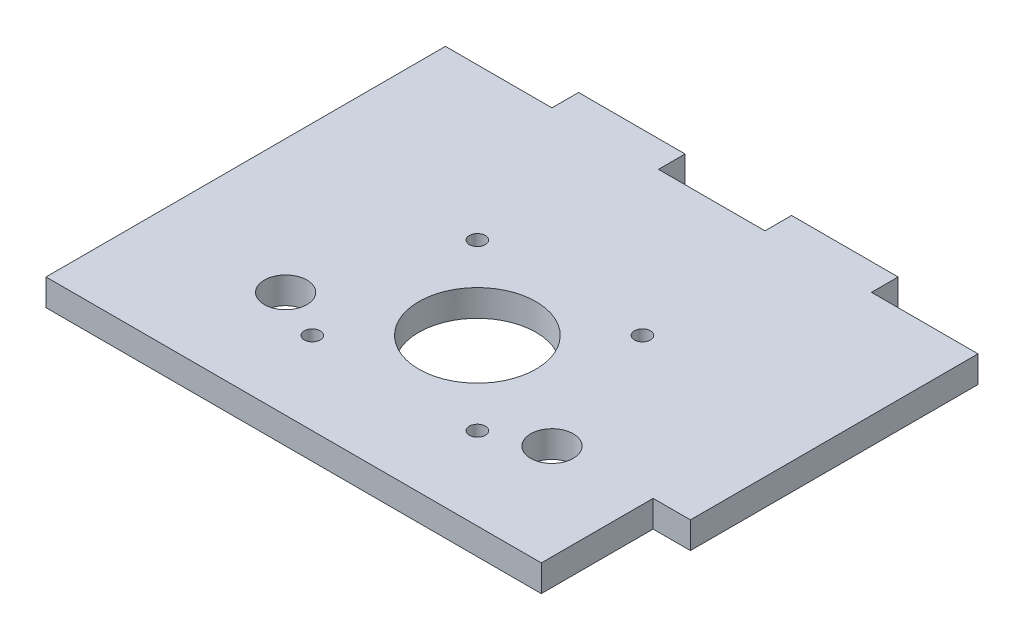
ISO-10303-21;
HEADER;
FILE_DESCRIPTION(('STEP AP214'),'2;1');
FILE_NAME('part.step','',(''),(''),'','','');
FILE_SCHEMA(('AUTOMOTIVE_DESIGN { 1 0 10303 214 1 1 1 1 }'));
ENDSEC;
DATA;
#1=APPLICATION_CONTEXT('core data for automotive mechanical design processes');
#2=APPLICATION_PROTOCOL_DEFINITION('international standard','automotive_design',2000,#1);
#3=PRODUCT_CONTEXT('',#1,'mechanical');
#4=PRODUCT('Part','Part','',(#3));
#5=PRODUCT_RELATED_PRODUCT_CATEGORY('part','',(#4));
#6=PRODUCT_DEFINITION_FORMATION('','',#4);
#7=PRODUCT_DEFINITION_CONTEXT('part definition',#1,'design');
#8=PRODUCT_DEFINITION('design','',#6,#7);
#9=PRODUCT_DEFINITION_SHAPE('','',#8);
#10=(LENGTH_UNIT() NAMED_UNIT(*) SI_UNIT(.MILLI.,.METRE.));
#11=(NAMED_UNIT(*) PLANE_ANGLE_UNIT() SI_UNIT($,.RADIAN.));
#12=(NAMED_UNIT(*) SI_UNIT($,.STERADIAN.) SOLID_ANGLE_UNIT());
#13=UNCERTAINTY_MEASURE_WITH_UNIT(LENGTH_MEASURE(1.E-05),#10,'distance_accuracy_value','');
#14=(GEOMETRIC_REPRESENTATION_CONTEXT(3) GLOBAL_UNCERTAINTY_ASSIGNED_CONTEXT((#13)) GLOBAL_UNIT_ASSIGNED_CONTEXT((#10,
#11,#12)) REPRESENTATION_CONTEXT('',''));
#15=CARTESIAN_POINT('',(0.,0.,0.));
#16=DIRECTION('',(0.,0.,1.));
#17=DIRECTION('',(1.,0.,0.));
#18=AXIS2_PLACEMENT_3D('',#15,#16,#17);
#19=CARTESIAN_POINT('',(0.,5.,0.));
#20=DIRECTION('',(0.,-1.,0.));
#21=DIRECTION('',(0.,0.,-1.));
#22=AXIS2_PLACEMENT_3D('',#19,#20,#21);
#23=PLANE('',#22);
#24=CARTESIAN_POINT('',(0.,5.,0.));
#25=DIRECTION('',(0.,1.,0.));
#26=DIRECTION('',(0.,0.,1.));
#27=AXIS2_PLACEMENT_3D('',#24,#25,#26);
#28=CIRCLE('',#27,11.);
#29=CARTESIAN_POINT('',(0.,5.,11.));
#30=VERTEX_POINT('',#29);
#31=EDGE_CURVE('E296',#30,#30,#28,.T.);
#32=ORIENTED_EDGE('',*,*,#31,.F.);
#33=EDGE_LOOP('',(#32));
#34=FACE_BOUND('',#33,.T.);
#35=DIRECTION('',(0.,0.,1.));
#36=VECTOR('',#35,1.);
#37=CARTESIAN_POINT('',(43.,5.,31.));
#38=LINE('',#37,#36);
#39=CARTESIAN_POINT('',(43.,5.,10.));
#40=VERTEX_POINT('',#39);
#41=CARTESIAN_POINT('',(43.,5.,31.));
#42=VERTEX_POINT('',#41);
#43=EDGE_CURVE('E282',#40,#42,#38,.T.);
#44=ORIENTED_EDGE('',*,*,#43,.F.);
#45=DIRECTION('',(1.,0.,0.));
#46=VECTOR('',#45,1.);
#47=CARTESIAN_POINT('',(43.,5.,10.));
#48=LINE('',#47,#46);
#49=CARTESIAN_POINT('',(50.,5.,10.));
#50=VERTEX_POINT('',#49);
#51=EDGE_CURVE('E266',#40,#50,#48,.T.);
#52=ORIENTED_EDGE('',*,*,#51,.T.);
#53=DIRECTION('',(0.,0.,-1.));
#54=VECTOR('',#53,1.);
#55=CARTESIAN_POINT('',(50.,5.,31.));
#56=LINE('',#55,#54);
#57=CARTESIAN_POINT('',(50.,5.,-44.));
#58=VERTEX_POINT('',#57);
#59=EDGE_CURVE('E258',#50,#58,#56,.T.);
#60=ORIENTED_EDGE('',*,*,#59,.T.);
#61=DIRECTION('',(-1.,0.,0.));
#62=VECTOR('',#61,1.);
#63=CARTESIAN_POINT('',(30.,5.,-44.));
#64=LINE('',#63,#62);
#65=CARTESIAN_POINT('',(30.,5.,-44.));
#66=VERTEX_POINT('',#65);
#67=EDGE_CURVE('E215',#58,#66,#64,.T.);
#68=ORIENTED_EDGE('',*,*,#67,.T.);
#69=DIRECTION('',(0.,0.,-1.));
#70=VECTOR('',#69,1.);
#71=CARTESIAN_POINT('',(30.,5.,-49.));
#72=LINE('',#71,#70);
#73=CARTESIAN_POINT('',(30.,5.,-49.));
#74=VERTEX_POINT('',#73);
#75=EDGE_CURVE('E236',#66,#74,#72,.T.);
#76=ORIENTED_EDGE('',*,*,#75,.T.);
#77=DIRECTION('',(-1.,0.,0.));
#78=VECTOR('',#77,1.);
#79=CARTESIAN_POINT('',(10.,5.,-49.));
#80=LINE('',#79,#78);
#81=CARTESIAN_POINT('',(10.,5.,-49.));
#82=VERTEX_POINT('',#81);
#83=EDGE_CURVE('E233',#74,#82,#80,.T.);
#84=ORIENTED_EDGE('',*,*,#83,.T.);
#85=DIRECTION('',(0.,0.,1.));
#86=VECTOR('',#85,1.);
#87=CARTESIAN_POINT('',(10.,5.,-49.));
#88=LINE('',#87,#86);
#89=CARTESIAN_POINT('',(10.,5.,-44.));
#90=VERTEX_POINT('',#89);
#91=EDGE_CURVE('E235',#82,#90,#88,.T.);
#92=ORIENTED_EDGE('',*,*,#91,.T.);
#93=DIRECTION('',(-1.,0.,0.));
#94=VECTOR('',#93,1.);
#95=CARTESIAN_POINT('',(-10.,5.,-44.));
#96=LINE('',#95,#94);
#97=CARTESIAN_POINT('',(-10.,5.,-44.));
#98=VERTEX_POINT('',#97);
#99=EDGE_CURVE('E238',#90,#98,#96,.T.);
#100=ORIENTED_EDGE('',*,*,#99,.T.);
#101=DIRECTION('',(0.,0.,-1.));
#102=VECTOR('',#101,1.);
#103=CARTESIAN_POINT('',(-10.,5.,-49.));
#104=LINE('',#103,#102);
#105=CARTESIAN_POINT('',(-10.,5.,-49.));
#106=VERTEX_POINT('',#105);
#107=EDGE_CURVE('E144',#98,#106,#104,.T.);
#108=ORIENTED_EDGE('',*,*,#107,.T.);
#109=DIRECTION('',(-1.,0.,0.));
#110=VECTOR('',#109,1.);
#111=CARTESIAN_POINT('',(-30.,5.,-49.));
#112=LINE('',#111,#110);
#113=CARTESIAN_POINT('',(-30.,5.,-49.));
#114=VERTEX_POINT('',#113);
#115=EDGE_CURVE('E136',#106,#114,#112,.T.);
#116=ORIENTED_EDGE('',*,*,#115,.T.);
#117=DIRECTION('',(0.,0.,1.));
#118=VECTOR('',#117,1.);
#119=CARTESIAN_POINT('',(-30.,5.,-49.));
#120=LINE('',#119,#118);
#121=CARTESIAN_POINT('',(-30.,5.,-44.));
#122=VERTEX_POINT('',#121);
#123=EDGE_CURVE('E141',#114,#122,#120,.T.);
#124=ORIENTED_EDGE('',*,*,#123,.T.);
#125=DIRECTION('',(-1.,0.,0.));
#126=VECTOR('',#125,1.);
#127=CARTESIAN_POINT('',(-50.,5.,-44.));
#128=LINE('',#127,#126);
#129=CARTESIAN_POINT('',(-50.,5.,-44.));
#130=VERTEX_POINT('',#129);
#131=EDGE_CURVE('E60',#122,#130,#128,.T.);
#132=ORIENTED_EDGE('',*,*,#131,.T.);
#133=DIRECTION('',(0.,0.,1.));
#134=VECTOR('',#133,1.);
#135=CARTESIAN_POINT('',(-50.,5.,31.));
#136=LINE('',#135,#134);
#137=CARTESIAN_POINT('',(-50.,5.,31.));
#138=VERTEX_POINT('',#137);
#139=EDGE_CURVE('E190',#130,#138,#136,.T.);
#140=ORIENTED_EDGE('',*,*,#139,.T.);
#141=DIRECTION('',(1.,0.,0.));
#142=VECTOR('',#141,1.);
#143=CARTESIAN_POINT('',(-50.,5.,31.));
#144=LINE('',#143,#142);
#145=EDGE_CURVE('E110',#138,#42,#144,.T.);
#146=ORIENTED_EDGE('',*,*,#145,.T.);
#147=EDGE_LOOP('',(#44,#52,#60,#68,#76,#84,#92,#100,#108,#116,#124,#132,#140,#146));
#148=FACE_BOUND('',#147,.T.);
#149=CARTESIAN_POINT('',(-15.5000000000001,5.,-15.5000000000001));
#150=DIRECTION('',(0.,1.,0.));
#151=DIRECTION('',(0.,0.,-1.));
#152=AXIS2_PLACEMENT_3D('',#149,#150,#151);
#153=CIRCLE('',#152,1.5);
#154=CARTESIAN_POINT('',(-15.5000000000001,5.,-17.0000000000001));
#155=VERTEX_POINT('',#154);
#156=EDGE_CURVE('E169',#155,#155,#153,.T.);
#157=ORIENTED_EDGE('',*,*,#156,.F.);
#158=EDGE_LOOP('',(#157));
#159=FACE_BOUND('',#158,.T.);
#160=CARTESIAN_POINT('',(15.5,5.,-15.5000000000001));
#161=DIRECTION('',(0.,1.,0.));
#162=DIRECTION('',(0.,0.,1.));
#163=AXIS2_PLACEMENT_3D('',#160,#161,#162);
#164=CIRCLE('',#163,1.5);
#165=CARTESIAN_POINT('',(15.5,5.,-14.0000000000001));
#166=VERTEX_POINT('',#165);
#167=EDGE_CURVE('E326',#166,#166,#164,.T.);
#168=ORIENTED_EDGE('',*,*,#167,.F.);
#169=EDGE_LOOP('',(#168));
#170=FACE_BOUND('',#169,.T.);
#171=CARTESIAN_POINT('',(-15.5000000000001,5.,15.5000000000001));
#172=DIRECTION('',(0.,1.,0.));
#173=DIRECTION('',(0.,0.,1.));
#174=AXIS2_PLACEMENT_3D('',#171,#172,#173);
#175=CIRCLE('',#174,1.5);
#176=CARTESIAN_POINT('',(-15.5000000000001,5.,17.0000000000001));
#177=VERTEX_POINT('',#176);
#178=EDGE_CURVE('E320',#177,#177,#175,.T.);
#179=ORIENTED_EDGE('',*,*,#178,.F.);
#180=EDGE_LOOP('',(#179));
#181=FACE_BOUND('',#180,.T.);
#182=CARTESIAN_POINT('',(15.5,5.,15.5000000000001));
#183=DIRECTION('',(0.,1.,0.));
#184=DIRECTION('',(0.,0.,-1.));
#185=AXIS2_PLACEMENT_3D('',#182,#183,#184);
#186=CIRCLE('',#185,1.5);
#187=CARTESIAN_POINT('',(15.5,5.,14.0000000000001));
#188=VERTEX_POINT('',#187);
#189=EDGE_CURVE('E314',#188,#188,#186,.T.);
#190=ORIENTED_EDGE('',*,*,#189,.F.);
#191=EDGE_LOOP('',(#190));
#192=FACE_BOUND('',#191,.T.);
#193=CARTESIAN_POINT('',(25.,5.,11.));
#194=DIRECTION('',(0.,1.,0.));
#195=DIRECTION('',(0.,0.,1.));
#196=AXIS2_PLACEMENT_3D('',#193,#194,#195);
#197=CIRCLE('',#196,3.99999999999996);
#198=CARTESIAN_POINT('',(25.,5.,15.));
#199=VERTEX_POINT('',#198);
#200=EDGE_CURVE('E308',#199,#199,#197,.T.);
#201=ORIENTED_EDGE('',*,*,#200,.F.);
#202=EDGE_LOOP('',(#201));
#203=FACE_BOUND('',#202,.T.);
#204=CARTESIAN_POINT('',(-25.,5.,11.));
#205=DIRECTION('',(0.,1.,0.));
#206=DIRECTION('',(0.,0.,-1.));
#207=AXIS2_PLACEMENT_3D('',#204,#205,#206);
#208=CIRCLE('',#207,3.99999999999996);
#209=CARTESIAN_POINT('',(-25.,5.,7.00000000000005));
#210=VERTEX_POINT('',#209);
#211=EDGE_CURVE('E302',#210,#210,#208,.T.);
#212=ORIENTED_EDGE('',*,*,#211,.F.);
#213=EDGE_LOOP('',(#212));
#214=FACE_BOUND('',#213,.T.);
#215=ADVANCED_FACE('F36',(#34,#148,#159,#170,#181,#192,#203,#214),#23,.F.);
#216=CARTESIAN_POINT('',(0.,0.,0.));
#217=DIRECTION('',(0.,-1.,0.));
#218=DIRECTION('',(0.,0.,-1.));
#219=AXIS2_PLACEMENT_3D('',#216,#217,#218);
#220=PLANE('',#219);
#221=DIRECTION('',(1.,0.,0.));
#222=VECTOR('',#221,1.);
#223=CARTESIAN_POINT('',(43.,0.,10.));
#224=LINE('',#223,#222);
#225=CARTESIAN_POINT('',(43.,0.,10.));
#226=VERTEX_POINT('',#225);
#227=CARTESIAN_POINT('',(50.,0.,10.));
#228=VERTEX_POINT('',#227);
#229=EDGE_CURVE('E51',#226,#228,#224,.T.);
#230=ORIENTED_EDGE('',*,*,#229,.F.);
#231=DIRECTION('',(0.,0.,-1.));
#232=VECTOR('',#231,1.);
#233=CARTESIAN_POINT('',(43.,0.,31.));
#234=LINE('',#233,#232);
#235=CARTESIAN_POINT('',(43.,0.,31.));
#236=VERTEX_POINT('',#235);
#237=EDGE_CURVE('E287',#236,#226,#234,.T.);
#238=ORIENTED_EDGE('',*,*,#237,.F.);
#239=DIRECTION('',(1.,0.,0.));
#240=VECTOR('',#239,1.);
#241=CARTESIAN_POINT('',(-50.,0.,31.));
#242=LINE('',#241,#240);
#243=CARTESIAN_POINT('',(-50.,0.,31.));
#244=VERTEX_POINT('',#243);
#245=EDGE_CURVE('E168',#244,#236,#242,.T.);
#246=ORIENTED_EDGE('',*,*,#245,.F.);
#247=DIRECTION('',(0.,0.,1.));
#248=VECTOR('',#247,1.);
#249=CARTESIAN_POINT('',(-50.,0.,31.));
#250=LINE('',#249,#248);
#251=CARTESIAN_POINT('',(-50.,0.,-44.));
#252=VERTEX_POINT('',#251);
#253=EDGE_CURVE('E165',#252,#244,#250,.T.);
#254=ORIENTED_EDGE('',*,*,#253,.F.);
#255=DIRECTION('',(-1.,0.,0.));
#256=VECTOR('',#255,1.);
#257=CARTESIAN_POINT('',(-50.,0.,-44.));
#258=LINE('',#257,#256);
#259=CARTESIAN_POINT('',(-30.,0.,-44.));
#260=VERTEX_POINT('',#259);
#261=EDGE_CURVE('E102',#260,#252,#258,.T.);
#262=ORIENTED_EDGE('',*,*,#261,.F.);
#263=DIRECTION('',(0.,0.,1.));
#264=VECTOR('',#263,1.);
#265=CARTESIAN_POINT('',(-30.,0.,-49.));
#266=LINE('',#265,#264);
#267=CARTESIAN_POINT('',(-30.,0.,-49.));
#268=VERTEX_POINT('',#267);
#269=EDGE_CURVE('E187',#268,#260,#266,.T.);
#270=ORIENTED_EDGE('',*,*,#269,.F.);
#271=DIRECTION('',(-1.,0.,0.));
#272=VECTOR('',#271,1.);
#273=CARTESIAN_POINT('',(-30.,0.,-49.));
#274=LINE('',#273,#272);
#275=CARTESIAN_POINT('',(-10.,0.,-49.));
#276=VERTEX_POINT('',#275);
#277=EDGE_CURVE('E153',#276,#268,#274,.T.);
#278=ORIENTED_EDGE('',*,*,#277,.F.);
#279=DIRECTION('',(0.,0.,-1.));
#280=VECTOR('',#279,1.);
#281=CARTESIAN_POINT('',(-10.,0.,-49.));
#282=LINE('',#281,#280);
#283=CARTESIAN_POINT('',(-10.,0.,-44.));
#284=VERTEX_POINT('',#283);
#285=EDGE_CURVE('E184',#284,#276,#282,.T.);
#286=ORIENTED_EDGE('',*,*,#285,.F.);
#287=DIRECTION('',(-1.,0.,0.));
#288=VECTOR('',#287,1.);
#289=CARTESIAN_POINT('',(-10.,0.,-44.));
#290=LINE('',#289,#288);
#291=CARTESIAN_POINT('',(10.,0.,-44.));
#292=VERTEX_POINT('',#291);
#293=EDGE_CURVE('E182',#292,#284,#290,.T.);
#294=ORIENTED_EDGE('',*,*,#293,.F.);
#295=DIRECTION('',(0.,0.,1.));
#296=VECTOR('',#295,1.);
#297=CARTESIAN_POINT('',(10.,0.,-49.));
#298=LINE('',#297,#296);
#299=CARTESIAN_POINT('',(10.,0.,-49.));
#300=VERTEX_POINT('',#299);
#301=EDGE_CURVE('E180',#300,#292,#298,.T.);
#302=ORIENTED_EDGE('',*,*,#301,.F.);
#303=DIRECTION('',(-1.,0.,0.));
#304=VECTOR('',#303,1.);
#305=CARTESIAN_POINT('',(10.,0.,-49.));
#306=LINE('',#305,#304);
#307=CARTESIAN_POINT('',(30.,0.,-49.));
#308=VERTEX_POINT('',#307);
#309=EDGE_CURVE('E178',#308,#300,#306,.T.);
#310=ORIENTED_EDGE('',*,*,#309,.F.);
#311=DIRECTION('',(0.,0.,-1.));
#312=VECTOR('',#311,1.);
#313=CARTESIAN_POINT('',(30.,0.,-49.));
#314=LINE('',#313,#312);
#315=CARTESIAN_POINT('',(30.,0.,-44.));
#316=VERTEX_POINT('',#315);
#317=EDGE_CURVE('E176',#316,#308,#314,.T.);
#318=ORIENTED_EDGE('',*,*,#317,.F.);
#319=DIRECTION('',(-1.,0.,0.));
#320=VECTOR('',#319,1.);
#321=CARTESIAN_POINT('',(30.,0.,-44.));
#322=LINE('',#321,#320);
#323=CARTESIAN_POINT('',(50.,0.,-44.));
#324=VERTEX_POINT('',#323);
#325=EDGE_CURVE('E174',#324,#316,#322,.T.);
#326=ORIENTED_EDGE('',*,*,#325,.F.);
#327=DIRECTION('',(0.,0.,-1.));
#328=VECTOR('',#327,1.);
#329=CARTESIAN_POINT('',(50.,0.,31.));
#330=LINE('',#329,#328);
#331=EDGE_CURVE('E172',#228,#324,#330,.T.);
#332=ORIENTED_EDGE('',*,*,#331,.F.);
#333=EDGE_LOOP('',(#230,#238,#246,#254,#262,#270,#278,#286,#294,#302,#310,#318,#326,#332));
#334=FACE_BOUND('',#333,.T.);
#335=CARTESIAN_POINT('',(0.,0.,0.));
#336=DIRECTION('',(0.,-1.,0.));
#337=DIRECTION('',(0.,0.,-1.));
#338=AXIS2_PLACEMENT_3D('',#335,#336,#337);
#339=CIRCLE('',#338,11.);
#340=CARTESIAN_POINT('',(0.,0.,-11.));
#341=VERTEX_POINT('',#340);
#342=EDGE_CURVE('E294',#341,#341,#339,.F.);
#343=ORIENTED_EDGE('',*,*,#342,.T.);
#344=EDGE_LOOP('',(#343));
#345=FACE_BOUND('',#344,.T.);
#346=CARTESIAN_POINT('',(25.,0.,11.));
#347=DIRECTION('',(0.,1.,0.));
#348=DIRECTION('',(0.,0.,1.));
#349=AXIS2_PLACEMENT_3D('',#346,#347,#348);
#350=CIRCLE('',#349,3.99999999999996);
#351=CARTESIAN_POINT('',(25.,0.,15.));
#352=VERTEX_POINT('',#351);
#353=EDGE_CURVE('E305',#352,#352,#350,.T.);
#354=ORIENTED_EDGE('',*,*,#353,.T.);
#355=EDGE_LOOP('',(#354));
#356=FACE_BOUND('',#355,.T.);
#357=CARTESIAN_POINT('',(-15.5000000000001,0.,15.5000000000001));
#358=DIRECTION('',(0.,1.,0.));
#359=DIRECTION('',(0.,0.,1.));
#360=AXIS2_PLACEMENT_3D('',#357,#358,#359);
#361=CIRCLE('',#360,1.5);
#362=CARTESIAN_POINT('',(-15.5000000000001,0.,17.0000000000001));
#363=VERTEX_POINT('',#362);
#364=EDGE_CURVE('E317',#363,#363,#361,.T.);
#365=ORIENTED_EDGE('',*,*,#364,.T.);
#366=EDGE_LOOP('',(#365));
#367=FACE_BOUND('',#366,.T.);
#368=CARTESIAN_POINT('',(-15.5000000000001,0.,-15.5000000000001));
#369=DIRECTION('',(0.,1.,0.));
#370=DIRECTION('',(0.,0.,-1.));
#371=AXIS2_PLACEMENT_3D('',#368,#369,#370);
#372=CIRCLE('',#371,1.5);
#373=CARTESIAN_POINT('',(-15.5000000000001,0.,-17.0000000000001));
#374=VERTEX_POINT('',#373);
#375=EDGE_CURVE('E261',#374,#374,#372,.T.);
#376=ORIENTED_EDGE('',*,*,#375,.T.);
#377=EDGE_LOOP('',(#376));
#378=FACE_BOUND('',#377,.T.);
#379=CARTESIAN_POINT('',(15.5,0.,-15.5000000000001));
#380=DIRECTION('',(0.,1.,0.));
#381=DIRECTION('',(0.,0.,1.));
#382=AXIS2_PLACEMENT_3D('',#379,#380,#381);
#383=CIRCLE('',#382,1.5);
#384=CARTESIAN_POINT('',(15.5,0.,-14.0000000000001));
#385=VERTEX_POINT('',#384);
#386=EDGE_CURVE('E323',#385,#385,#383,.T.);
#387=ORIENTED_EDGE('',*,*,#386,.T.);
#388=EDGE_LOOP('',(#387));
#389=FACE_BOUND('',#388,.T.);
#390=CARTESIAN_POINT('',(15.5,0.,15.5000000000001));
#391=DIRECTION('',(0.,1.,0.));
#392=DIRECTION('',(0.,0.,-1.));
#393=AXIS2_PLACEMENT_3D('',#390,#391,#392);
#394=CIRCLE('',#393,1.5);
#395=CARTESIAN_POINT('',(15.5,0.,14.0000000000001));
#396=VERTEX_POINT('',#395);
#397=EDGE_CURVE('E311',#396,#396,#394,.T.);
#398=ORIENTED_EDGE('',*,*,#397,.T.);
#399=EDGE_LOOP('',(#398));
#400=FACE_BOUND('',#399,.T.);
#401=CARTESIAN_POINT('',(-25.,0.,11.));
#402=DIRECTION('',(0.,1.,0.));
#403=DIRECTION('',(0.,0.,-1.));
#404=AXIS2_PLACEMENT_3D('',#401,#402,#403);
#405=CIRCLE('',#404,3.99999999999996);
#406=CARTESIAN_POINT('',(-25.,0.,7.00000000000005));
#407=VERTEX_POINT('',#406);
#408=EDGE_CURVE('E299',#407,#407,#405,.T.);
#409=ORIENTED_EDGE('',*,*,#408,.T.);
#410=EDGE_LOOP('',(#409));
#411=FACE_BOUND('',#410,.T.);
#412=ADVANCED_FACE('F221',(#334,#345,#356,#367,#378,#389,#400,#411),#220,.T.);
#413=CARTESIAN_POINT('',(-50.,5.,31.));
#414=DIRECTION('',(1.,0.,0.));
#415=DIRECTION('',(0.,0.,-1.));
#416=AXIS2_PLACEMENT_3D('',#413,#414,#415);
#417=PLANE('',#416);
#418=ORIENTED_EDGE('',*,*,#253,.T.);
#419=DIRECTION('',(0.,-1.,0.));
#420=VECTOR('',#419,1.);
#421=CARTESIAN_POINT('',(-50.,5.,31.));
#422=LINE('',#421,#420);
#423=EDGE_CURVE('E11',#138,#244,#422,.T.);
#424=ORIENTED_EDGE('',*,*,#423,.F.);
#425=ORIENTED_EDGE('',*,*,#139,.F.);
#426=DIRECTION('',(0.,-1.,0.));
#427=VECTOR('',#426,1.);
#428=CARTESIAN_POINT('',(-50.,5.,-44.));
#429=LINE('',#428,#427);
#430=EDGE_CURVE('E161',#130,#252,#429,.T.);
#431=ORIENTED_EDGE('',*,*,#430,.T.);
#432=EDGE_LOOP('',(#418,#424,#425,#431));
#433=FACE_BOUND('',#432,.T.);
#434=ADVANCED_FACE('F38',(#433),#417,.F.);
#435=CARTESIAN_POINT('',(-50.,5.,31.));
#436=DIRECTION('',(0.,0.,-1.));
#437=DIRECTION('',(-1.,0.,0.));
#438=AXIS2_PLACEMENT_3D('',#435,#436,#437);
#439=PLANE('',#438);
#440=ORIENTED_EDGE('',*,*,#245,.T.);
#441=DIRECTION('',(0.,-1.,0.));
#442=VECTOR('',#441,1.);
#443=CARTESIAN_POINT('',(43.,0.,31.));
#444=LINE('',#443,#442);
#445=EDGE_CURVE('E276',#42,#236,#444,.T.);
#446=ORIENTED_EDGE('',*,*,#445,.F.);
#447=ORIENTED_EDGE('',*,*,#145,.F.);
#448=ORIENTED_EDGE('',*,*,#423,.T.);
#449=EDGE_LOOP('',(#440,#446,#447,#448));
#450=FACE_BOUND('',#449,.T.);
#451=ADVANCED_FACE('F286',(#450),#439,.F.);
#452=CARTESIAN_POINT('',(50.,5.,31.));
#453=DIRECTION('',(-1.,0.,0.));
#454=DIRECTION('',(0.,0.,1.));
#455=AXIS2_PLACEMENT_3D('',#452,#453,#454);
#456=PLANE('',#455);
#457=ORIENTED_EDGE('',*,*,#59,.F.);
#458=DIRECTION('',(0.,1.,0.));
#459=VECTOR('',#458,1.);
#460=CARTESIAN_POINT('',(50.,0.,10.));
#461=LINE('',#460,#459);
#462=EDGE_CURVE('E268',#228,#50,#461,.T.);
#463=ORIENTED_EDGE('',*,*,#462,.F.);
#464=ORIENTED_EDGE('',*,*,#331,.T.);
#465=DIRECTION('',(0.,-1.,0.));
#466=VECTOR('',#465,1.);
#467=CARTESIAN_POINT('',(50.,5.,-44.));
#468=LINE('',#467,#466);
#469=EDGE_CURVE('E44',#58,#324,#468,.T.);
#470=ORIENTED_EDGE('',*,*,#469,.F.);
#471=EDGE_LOOP('',(#457,#463,#464,#470));
#472=FACE_BOUND('',#471,.T.);
#473=ADVANCED_FACE('F267',(#472),#456,.F.);
#474=CARTESIAN_POINT('',(30.,5.,-44.));
#475=DIRECTION('',(0.,0.,1.));
#476=DIRECTION('',(1.,0.,0.));
#477=AXIS2_PLACEMENT_3D('',#474,#475,#476);
#478=PLANE('',#477);
#479=ORIENTED_EDGE('',*,*,#325,.T.);
#480=DIRECTION('',(0.,-1.,0.));
#481=VECTOR('',#480,1.);
#482=CARTESIAN_POINT('',(30.,5.,-44.));
#483=LINE('',#482,#481);
#484=EDGE_CURVE('E206',#66,#316,#483,.T.);
#485=ORIENTED_EDGE('',*,*,#484,.F.);
#486=ORIENTED_EDGE('',*,*,#67,.F.);
#487=ORIENTED_EDGE('',*,*,#469,.T.);
#488=EDGE_LOOP('',(#479,#485,#486,#487));
#489=FACE_BOUND('',#488,.T.);
#490=ADVANCED_FACE('F213',(#489),#478,.F.);
#491=CARTESIAN_POINT('',(30.,5.,-49.));
#492=DIRECTION('',(-1.,0.,0.));
#493=DIRECTION('',(0.,0.,1.));
#494=AXIS2_PLACEMENT_3D('',#491,#492,#493);
#495=PLANE('',#494);
#496=ORIENTED_EDGE('',*,*,#317,.T.);
#497=DIRECTION('',(0.,-1.,0.));
#498=VECTOR('',#497,1.);
#499=CARTESIAN_POINT('',(30.,5.,-49.));
#500=LINE('',#499,#498);
#501=EDGE_CURVE('E203',#74,#308,#500,.T.);
#502=ORIENTED_EDGE('',*,*,#501,.F.);
#503=ORIENTED_EDGE('',*,*,#75,.F.);
#504=ORIENTED_EDGE('',*,*,#484,.T.);
#505=EDGE_LOOP('',(#496,#502,#503,#504));
#506=FACE_BOUND('',#505,.T.);
#507=ADVANCED_FACE('F227',(#506),#495,.F.);
#508=CARTESIAN_POINT('',(10.,5.,-49.));
#509=DIRECTION('',(0.,0.,1.));
#510=DIRECTION('',(1.,0.,0.));
#511=AXIS2_PLACEMENT_3D('',#508,#509,#510);
#512=PLANE('',#511);
#513=ORIENTED_EDGE('',*,*,#309,.T.);
#514=DIRECTION('',(0.,-1.,0.));
#515=VECTOR('',#514,1.);
#516=CARTESIAN_POINT('',(10.,5.,-49.));
#517=LINE('',#516,#515);
#518=EDGE_CURVE('E200',#82,#300,#517,.T.);
#519=ORIENTED_EDGE('',*,*,#518,.F.);
#520=ORIENTED_EDGE('',*,*,#83,.F.);
#521=ORIENTED_EDGE('',*,*,#501,.T.);
#522=EDGE_LOOP('',(#513,#519,#520,#521));
#523=FACE_BOUND('',#522,.T.);
#524=ADVANCED_FACE('F231',(#523),#512,.F.);
#525=CARTESIAN_POINT('',(10.,5.,-49.));
#526=DIRECTION('',(1.,0.,0.));
#527=DIRECTION('',(0.,0.,-1.));
#528=AXIS2_PLACEMENT_3D('',#525,#526,#527);
#529=PLANE('',#528);
#530=ORIENTED_EDGE('',*,*,#301,.T.);
#531=DIRECTION('',(0.,-1.,0.));
#532=VECTOR('',#531,1.);
#533=CARTESIAN_POINT('',(10.,5.,-44.));
#534=LINE('',#533,#532);
#535=EDGE_CURVE('E197',#90,#292,#534,.T.);
#536=ORIENTED_EDGE('',*,*,#535,.F.);
#537=ORIENTED_EDGE('',*,*,#91,.F.);
#538=ORIENTED_EDGE('',*,*,#518,.T.);
#539=EDGE_LOOP('',(#530,#536,#537,#538));
#540=FACE_BOUND('',#539,.T.);
#541=ADVANCED_FACE('F367',(#540),#529,.F.);
#542=CARTESIAN_POINT('',(-10.,5.,-44.));
#543=DIRECTION('',(0.,0.,1.));
#544=DIRECTION('',(1.,0.,0.));
#545=AXIS2_PLACEMENT_3D('',#542,#543,#544);
#546=PLANE('',#545);
#547=ORIENTED_EDGE('',*,*,#293,.T.);
#548=DIRECTION('',(0.,-1.,0.));
#549=VECTOR('',#548,1.);
#550=CARTESIAN_POINT('',(-10.,5.,-44.));
#551=LINE('',#550,#549);
#552=EDGE_CURVE('E194',#98,#284,#551,.T.);
#553=ORIENTED_EDGE('',*,*,#552,.F.);
#554=ORIENTED_EDGE('',*,*,#99,.F.);
#555=ORIENTED_EDGE('',*,*,#535,.T.);
#556=EDGE_LOOP('',(#547,#553,#554,#555));
#557=FACE_BOUND('',#556,.T.);
#558=ADVANCED_FACE('F247',(#557),#546,.F.);
#559=CARTESIAN_POINT('',(-10.,5.,-49.));
#560=DIRECTION('',(-1.,0.,0.));
#561=DIRECTION('',(0.,0.,1.));
#562=AXIS2_PLACEMENT_3D('',#559,#560,#561);
#563=PLANE('',#562);
#564=ORIENTED_EDGE('',*,*,#285,.T.);
#565=DIRECTION('',(0.,-1.,0.));
#566=VECTOR('',#565,1.);
#567=CARTESIAN_POINT('',(-10.,5.,-49.));
#568=LINE('',#567,#566);
#569=EDGE_CURVE('E156',#106,#276,#568,.T.);
#570=ORIENTED_EDGE('',*,*,#569,.F.);
#571=ORIENTED_EDGE('',*,*,#107,.F.);
#572=ORIENTED_EDGE('',*,*,#552,.T.);
#573=EDGE_LOOP('',(#564,#570,#571,#572));
#574=FACE_BOUND('',#573,.T.);
#575=ADVANCED_FACE('F251',(#574),#563,.F.);
#576=CARTESIAN_POINT('',(-30.,5.,-49.));
#577=DIRECTION('',(0.,0.,1.));
#578=DIRECTION('',(1.,0.,0.));
#579=AXIS2_PLACEMENT_3D('',#576,#577,#578);
#580=PLANE('',#579);
#581=ORIENTED_EDGE('',*,*,#277,.T.);
#582=DIRECTION('',(0.,-1.,0.));
#583=VECTOR('',#582,1.);
#584=CARTESIAN_POINT('',(-30.,5.,-49.));
#585=LINE('',#584,#583);
#586=EDGE_CURVE('E150',#114,#268,#585,.T.);
#587=ORIENTED_EDGE('',*,*,#586,.F.);
#588=ORIENTED_EDGE('',*,*,#115,.F.);
#589=ORIENTED_EDGE('',*,*,#569,.T.);
#590=EDGE_LOOP('',(#581,#587,#588,#589));
#591=FACE_BOUND('',#590,.T.);
#592=ADVANCED_FACE('F151',(#591),#580,.F.);
#593=CARTESIAN_POINT('',(-30.,5.,-49.));
#594=DIRECTION('',(1.,0.,0.));
#595=DIRECTION('',(0.,0.,-1.));
#596=AXIS2_PLACEMENT_3D('',#593,#594,#595);
#597=PLANE('',#596);
#598=ORIENTED_EDGE('',*,*,#269,.T.);
#599=DIRECTION('',(0.,-1.,0.));
#600=VECTOR('',#599,1.);
#601=CARTESIAN_POINT('',(-30.,5.,-44.));
#602=LINE('',#601,#600);
#603=EDGE_CURVE('E157',#122,#260,#602,.T.);
#604=ORIENTED_EDGE('',*,*,#603,.F.);
#605=ORIENTED_EDGE('',*,*,#123,.F.);
#606=ORIENTED_EDGE('',*,*,#586,.T.);
#607=EDGE_LOOP('',(#598,#604,#605,#606));
#608=FACE_BOUND('',#607,.T.);
#609=ADVANCED_FACE('F159',(#608),#597,.F.);
#610=CARTESIAN_POINT('',(-50.,5.,-44.));
#611=DIRECTION('',(0.,0.,1.));
#612=DIRECTION('',(1.,0.,0.));
#613=AXIS2_PLACEMENT_3D('',#610,#611,#612);
#614=PLANE('',#613);
#615=ORIENTED_EDGE('',*,*,#261,.T.);
#616=ORIENTED_EDGE('',*,*,#430,.F.);
#617=ORIENTED_EDGE('',*,*,#131,.F.);
#618=ORIENTED_EDGE('',*,*,#603,.T.);
#619=EDGE_LOOP('',(#615,#616,#617,#618));
#620=FACE_BOUND('',#619,.T.);
#621=ADVANCED_FACE('F253',(#620),#614,.F.);
#622=CARTESIAN_POINT('',(-15.5000000000001,5.,-15.5000000000001));
#623=DIRECTION('',(0.,-1.,0.));
#624=DIRECTION('',(0.,0.,-1.));
#625=AXIS2_PLACEMENT_3D('',#622,#623,#624);
#626=CYLINDRICAL_SURFACE('',#625,1.5);
#627=ORIENTED_EDGE('',*,*,#156,.T.);
#628=EDGE_LOOP('',(#627));
#629=FACE_BOUND('',#628,.T.);
#630=ORIENTED_EDGE('',*,*,#375,.F.);
#631=EDGE_LOOP('',(#630));
#632=FACE_BOUND('',#631,.T.);
#633=ADVANCED_FACE('F338',(#629,#632),#626,.F.);
#634=CARTESIAN_POINT('',(15.5,5.,-15.5000000000001));
#635=DIRECTION('',(0.,-1.,0.));
#636=DIRECTION('',(0.,0.,-1.));
#637=AXIS2_PLACEMENT_3D('',#634,#635,#636);
#638=CYLINDRICAL_SURFACE('',#637,1.5);
#639=ORIENTED_EDGE('',*,*,#167,.T.);
#640=EDGE_LOOP('',(#639));
#641=FACE_BOUND('',#640,.T.);
#642=ORIENTED_EDGE('',*,*,#386,.F.);
#643=EDGE_LOOP('',(#642));
#644=FACE_BOUND('',#643,.T.);
#645=ADVANCED_FACE('F340',(#641,#644),#638,.F.);
#646=CARTESIAN_POINT('',(-15.5000000000001,5.,15.5000000000001));
#647=DIRECTION('',(0.,-1.,0.));
#648=DIRECTION('',(0.,0.,-1.));
#649=AXIS2_PLACEMENT_3D('',#646,#647,#648);
#650=CYLINDRICAL_SURFACE('',#649,1.5);
#651=ORIENTED_EDGE('',*,*,#178,.T.);
#652=EDGE_LOOP('',(#651));
#653=FACE_BOUND('',#652,.T.);
#654=ORIENTED_EDGE('',*,*,#364,.F.);
#655=EDGE_LOOP('',(#654));
#656=FACE_BOUND('',#655,.T.);
#657=ADVANCED_FACE('F346',(#653,#656),#650,.F.);
#658=CARTESIAN_POINT('',(15.5,5.,15.5000000000001));
#659=DIRECTION('',(0.,-1.,0.));
#660=DIRECTION('',(0.,0.,-1.));
#661=AXIS2_PLACEMENT_3D('',#658,#659,#660);
#662=CYLINDRICAL_SURFACE('',#661,1.5);
#663=ORIENTED_EDGE('',*,*,#189,.T.);
#664=EDGE_LOOP('',(#663));
#665=FACE_BOUND('',#664,.T.);
#666=ORIENTED_EDGE('',*,*,#397,.F.);
#667=EDGE_LOOP('',(#666));
#668=FACE_BOUND('',#667,.T.);
#669=ADVANCED_FACE('F437',(#665,#668),#662,.F.);
#670=CARTESIAN_POINT('',(25.,5.,11.));
#671=DIRECTION('',(0.,-1.,0.));
#672=DIRECTION('',(0.,0.,-1.));
#673=AXIS2_PLACEMENT_3D('',#670,#671,#672);
#674=CYLINDRICAL_SURFACE('',#673,3.99999999999996);
#675=ORIENTED_EDGE('',*,*,#200,.T.);
#676=EDGE_LOOP('',(#675));
#677=FACE_BOUND('',#676,.T.);
#678=ORIENTED_EDGE('',*,*,#353,.F.);
#679=EDGE_LOOP('',(#678));
#680=FACE_BOUND('',#679,.T.);
#681=ADVANCED_FACE('F433',(#677,#680),#674,.F.);
#682=CARTESIAN_POINT('',(-25.,5.,11.));
#683=DIRECTION('',(0.,-1.,0.));
#684=DIRECTION('',(0.,0.,-1.));
#685=AXIS2_PLACEMENT_3D('',#682,#683,#684);
#686=CYLINDRICAL_SURFACE('',#685,3.99999999999996);
#687=ORIENTED_EDGE('',*,*,#211,.T.);
#688=EDGE_LOOP('',(#687));
#689=FACE_BOUND('',#688,.T.);
#690=ORIENTED_EDGE('',*,*,#408,.F.);
#691=EDGE_LOOP('',(#690));
#692=FACE_BOUND('',#691,.T.);
#693=ADVANCED_FACE('F429',(#689,#692),#686,.F.);
#694=CARTESIAN_POINT('',(0.,-0.00100000000000013,0.));
#695=DIRECTION('',(0.,1.,0.));
#696=DIRECTION('',(0.,0.,1.));
#697=AXIS2_PLACEMENT_3D('',#694,#695,#696);
#698=CYLINDRICAL_SURFACE('',#697,11.);
#699=ORIENTED_EDGE('',*,*,#342,.F.);
#700=EDGE_LOOP('',(#699));
#701=FACE_BOUND('',#700,.T.);
#702=ORIENTED_EDGE('',*,*,#31,.T.);
#703=EDGE_LOOP('',(#702));
#704=FACE_BOUND('',#703,.T.);
#705=ADVANCED_FACE('F413',(#701,#704),#698,.F.);
#706=CARTESIAN_POINT('',(43.,0.,10.));
#707=DIRECTION('',(0.,0.,-1.));
#708=DIRECTION('',(0.,1.,0.));
#709=AXIS2_PLACEMENT_3D('',#706,#707,#708);
#710=PLANE('',#709);
#711=ORIENTED_EDGE('',*,*,#462,.T.);
#712=ORIENTED_EDGE('',*,*,#51,.F.);
#713=DIRECTION('',(0.,1.,0.));
#714=VECTOR('',#713,1.);
#715=CARTESIAN_POINT('',(43.,0.,10.));
#716=LINE('',#715,#714);
#717=EDGE_CURVE('E284',#226,#40,#716,.T.);
#718=ORIENTED_EDGE('',*,*,#717,.F.);
#719=ORIENTED_EDGE('',*,*,#229,.T.);
#720=EDGE_LOOP('',(#711,#712,#718,#719));
#721=FACE_BOUND('',#720,.T.);
#722=ADVANCED_FACE('F408',(#721),#710,.F.);
#723=CARTESIAN_POINT('',(43.,0.,0.));
#724=DIRECTION('',(-1.,0.,0.));
#725=DIRECTION('',(0.,0.,1.));
#726=AXIS2_PLACEMENT_3D('',#723,#724,#725);
#727=PLANE('',#726);
#728=ORIENTED_EDGE('',*,*,#445,.T.);
#729=ORIENTED_EDGE('',*,*,#237,.T.);
#730=ORIENTED_EDGE('',*,*,#717,.T.);
#731=ORIENTED_EDGE('',*,*,#43,.T.);
#732=EDGE_LOOP('',(#728,#729,#730,#731));
#733=FACE_BOUND('',#732,.T.);
#734=ADVANCED_FACE('F283',(#733),#727,.F.);
#735=CLOSED_SHELL('',(#215,#412,#434,#451,#473,#490,#507,#524,#541,#558,#575,#592,#609,#621,
#633,#645,#657,#669,#681,#693,#705,#722,#734));
#736=MANIFOLD_SOLID_BREP('B2',#735);
#737=ADVANCED_BREP_SHAPE_REPRESENTATION('',(#18,#736),#14);
#738=SHAPE_DEFINITION_REPRESENTATION(#9,#737);
ENDSEC;
END-ISO-10303-21;
